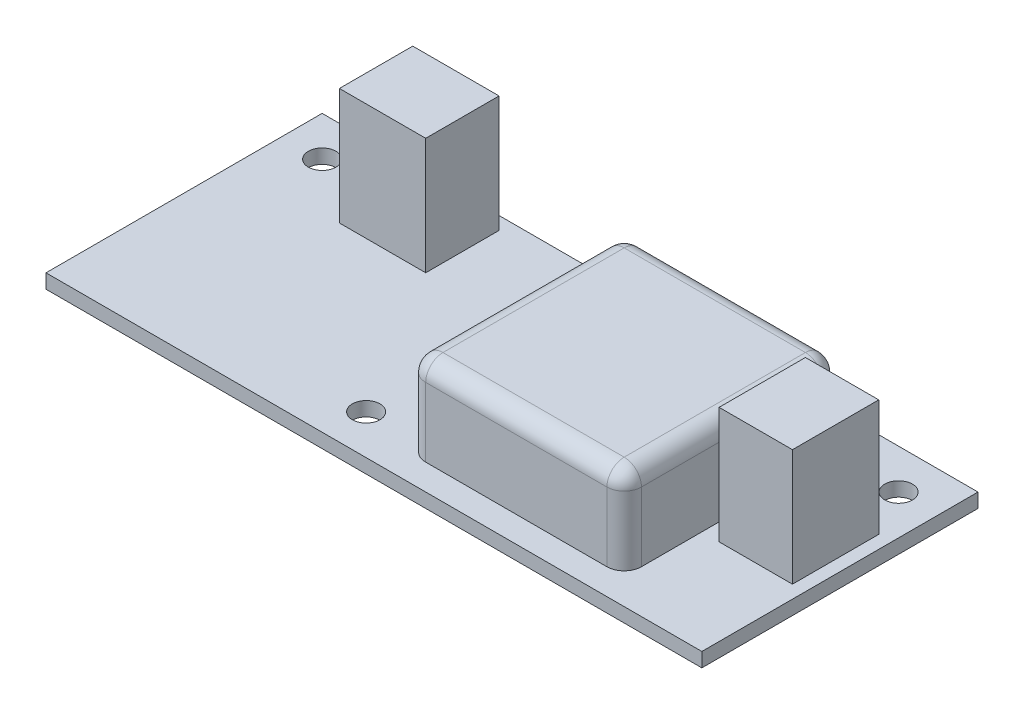
ISO-10303-21;
HEADER;
FILE_DESCRIPTION(('STEP AP214'),'2;1');
FILE_NAME('part.step','',(''),(''),'','','');
FILE_SCHEMA(('AUTOMOTIVE_DESIGN { 1 0 10303 214 1 1 1 1 }'));
ENDSEC;
DATA;
#1=APPLICATION_CONTEXT('core data for automotive mechanical design processes');
#2=APPLICATION_PROTOCOL_DEFINITION('international standard','automotive_design',2000,#1);
#3=PRODUCT_CONTEXT('',#1,'mechanical');
#4=PRODUCT('Part','Part','',(#3));
#5=PRODUCT_RELATED_PRODUCT_CATEGORY('part','',(#4));
#6=PRODUCT_DEFINITION_FORMATION('','',#4);
#7=PRODUCT_DEFINITION_CONTEXT('part definition',#1,'design');
#8=PRODUCT_DEFINITION('design','',#6,#7);
#9=PRODUCT_DEFINITION_SHAPE('','',#8);
#10=(LENGTH_UNIT() NAMED_UNIT(*) SI_UNIT(.MILLI.,.METRE.));
#11=(NAMED_UNIT(*) PLANE_ANGLE_UNIT() SI_UNIT($,.RADIAN.));
#12=(NAMED_UNIT(*) SI_UNIT($,.STERADIAN.) SOLID_ANGLE_UNIT());
#13=UNCERTAINTY_MEASURE_WITH_UNIT(LENGTH_MEASURE(1.E-05),#10,'distance_accuracy_value','');
#14=(GEOMETRIC_REPRESENTATION_CONTEXT(3) GLOBAL_UNCERTAINTY_ASSIGNED_CONTEXT((#13)) GLOBAL_UNIT_ASSIGNED_CONTEXT((#10,
#11,#12)) REPRESENTATION_CONTEXT('',''));
#15=CARTESIAN_POINT('',(0.,0.,0.));
#16=DIRECTION('',(0.,0.,1.));
#17=DIRECTION('',(1.,0.,0.));
#18=AXIS2_PLACEMENT_3D('',#15,#16,#17);
#19=CARTESIAN_POINT('',(0.,1.65,0.));
#20=DIRECTION('',(0.,-1.,0.));
#21=DIRECTION('',(0.,0.,-1.));
#22=AXIS2_PLACEMENT_3D('',#19,#20,#21);
#23=PLANE('',#22);
#24=DIRECTION('',(0.,0.,1.));
#25=VECTOR('',#24,1.);
#26=CARTESIAN_POINT('',(66.,1.65,-22.));
#27=LINE('',#26,#25);
#28=CARTESIAN_POINT('',(66.,1.65,-22.));
#29=VERTEX_POINT('',#28);
#30=CARTESIAN_POINT('',(66.,1.65,-12.));
#31=VERTEX_POINT('',#30);
#32=EDGE_CURVE('E206',#29,#31,#27,.T.);
#33=ORIENTED_EDGE('',*,*,#32,.F.);
#34=DIRECTION('',(-1.,0.,0.));
#35=VECTOR('',#34,1.);
#36=CARTESIAN_POINT('',(66.,1.65,-22.));
#37=LINE('',#36,#35);
#38=CARTESIAN_POINT('',(74.5,1.65,-22.));
#39=VERTEX_POINT('',#38);
#40=EDGE_CURVE('E203',#39,#29,#37,.T.);
#41=ORIENTED_EDGE('',*,*,#40,.F.);
#42=DIRECTION('',(0.,0.,-1.));
#43=VECTOR('',#42,1.);
#44=CARTESIAN_POINT('',(74.5,1.65,-22.));
#45=LINE('',#44,#43);
#46=CARTESIAN_POINT('',(74.5,1.65,-12.));
#47=VERTEX_POINT('',#46);
#48=EDGE_CURVE('E385',#47,#39,#45,.T.);
#49=ORIENTED_EDGE('',*,*,#48,.F.);
#50=DIRECTION('',(1.,0.,0.));
#51=VECTOR('',#50,1.);
#52=CARTESIAN_POINT('',(66.,1.65,-12.));
#53=LINE('',#52,#51);
#54=EDGE_CURVE('E383',#31,#47,#53,.T.);
#55=ORIENTED_EDGE('',*,*,#54,.F.);
#56=EDGE_LOOP('',(#33,#41,#49,#55));
#57=FACE_BOUND('',#56,.T.);
#58=DIRECTION('',(0.,0.,-1.));
#59=VECTOR('',#58,1.);
#60=CARTESIAN_POINT('',(0.,1.65,0.));
#61=LINE('',#60,#59);
#62=CARTESIAN_POINT('',(0.,1.65,0.));
#63=VERTEX_POINT('',#62);
#64=CARTESIAN_POINT('',(0.,1.65,-32.));
#65=VERTEX_POINT('',#64);
#66=EDGE_CURVE('E260',#63,#65,#61,.T.);
#67=ORIENTED_EDGE('',*,*,#66,.F.);
#68=DIRECTION('',(1.,0.,0.));
#69=VECTOR('',#68,1.);
#70=CARTESIAN_POINT('',(0.,1.65,0.));
#71=LINE('',#70,#69);
#72=CARTESIAN_POINT('',(76.,1.65,0.));
#73=VERTEX_POINT('',#72);
#74=EDGE_CURVE('E269',#63,#73,#71,.T.);
#75=ORIENTED_EDGE('',*,*,#74,.T.);
#76=DIRECTION('',(0.,0.,-1.));
#77=VECTOR('',#76,1.);
#78=CARTESIAN_POINT('',(76.,1.65,0.));
#79=LINE('',#78,#77);
#80=CARTESIAN_POINT('',(76.,1.65,-32.));
#81=VERTEX_POINT('',#80);
#82=EDGE_CURVE('E267',#73,#81,#79,.T.);
#83=ORIENTED_EDGE('',*,*,#82,.T.);
#84=DIRECTION('',(1.,0.,0.));
#85=VECTOR('',#84,1.);
#86=CARTESIAN_POINT('',(0.,1.65,-32.));
#87=LINE('',#86,#85);
#88=EDGE_CURVE('E263',#65,#81,#87,.T.);
#89=ORIENTED_EDGE('',*,*,#88,.F.);
#90=EDGE_LOOP('',(#67,#75,#83,#89));
#91=FACE_BOUND('',#90,.T.);
#92=CARTESIAN_POINT('',(4.6,1.65,-27.4));
#93=DIRECTION('',(0.,1.,0.));
#94=DIRECTION('',(0.,0.,1.));
#95=AXIS2_PLACEMENT_3D('',#92,#93,#94);
#96=CIRCLE('',#95,1.59999999999999);
#97=CARTESIAN_POINT('',(4.6,1.65,-25.8));
#98=VERTEX_POINT('',#97);
#99=EDGE_CURVE('E253',#98,#98,#96,.T.);
#100=ORIENTED_EDGE('',*,*,#99,.F.);
#101=EDGE_LOOP('',(#100));
#102=FACE_BOUND('',#101,.T.);
#103=CARTESIAN_POINT('',(32.5,1.65,-4.6));
#104=DIRECTION('',(0.,1.,0.));
#105=DIRECTION('',(0.,0.,1.));
#106=AXIS2_PLACEMENT_3D('',#103,#104,#105);
#107=CIRCLE('',#106,1.59999999999999);
#108=CARTESIAN_POINT('',(32.5,1.65,-3.00000000000001));
#109=VERTEX_POINT('',#108);
#110=EDGE_CURVE('E249',#109,#109,#107,.T.);
#111=ORIENTED_EDGE('',*,*,#110,.F.);
#112=EDGE_LOOP('',(#111));
#113=FACE_BOUND('',#112,.T.);
#114=CARTESIAN_POINT('',(71.4,1.65,-27.4));
#115=DIRECTION('',(0.,1.,0.));
#116=DIRECTION('',(0.,0.,1.));
#117=AXIS2_PLACEMENT_3D('',#114,#115,#116);
#118=CIRCLE('',#117,1.59999999999999);
#119=CARTESIAN_POINT('',(71.4,1.65,-25.8));
#120=VERTEX_POINT('',#119);
#121=EDGE_CURVE('E245',#120,#120,#118,.T.);
#122=ORIENTED_EDGE('',*,*,#121,.F.);
#123=EDGE_LOOP('',(#122));
#124=FACE_BOUND('',#123,.T.);
#125=DIRECTION('',(0.,0.,1.));
#126=VECTOR('',#125,1.);
#127=CARTESIAN_POINT('',(12.,1.65,-30.5));
#128=LINE('',#127,#126);
#129=CARTESIAN_POINT('',(12.,1.65,-30.5));
#130=VERTEX_POINT('',#129);
#131=CARTESIAN_POINT('',(12.,1.65,-22.));
#132=VERTEX_POINT('',#131);
#133=EDGE_CURVE('E207',#130,#132,#128,.T.);
#134=ORIENTED_EDGE('',*,*,#133,.F.);
#135=DIRECTION('',(-1.,0.,0.));
#136=VECTOR('',#135,1.);
#137=CARTESIAN_POINT('',(12.,1.65,-30.5));
#138=LINE('',#137,#136);
#139=CARTESIAN_POINT('',(22.,1.65,-30.5));
#140=VERTEX_POINT('',#139);
#141=EDGE_CURVE('E220',#140,#130,#138,.T.);
#142=ORIENTED_EDGE('',*,*,#141,.F.);
#143=DIRECTION('',(0.,0.,-1.));
#144=VECTOR('',#143,1.);
#145=CARTESIAN_POINT('',(22.,1.65,-30.5));
#146=LINE('',#145,#144);
#147=CARTESIAN_POINT('',(22.,1.65,-22.));
#148=VERTEX_POINT('',#147);
#149=EDGE_CURVE('E229',#148,#140,#146,.T.);
#150=ORIENTED_EDGE('',*,*,#149,.F.);
#151=DIRECTION('',(1.,0.,0.));
#152=VECTOR('',#151,1.);
#153=CARTESIAN_POINT('',(12.,1.65,-22.));
#154=LINE('',#153,#152);
#155=EDGE_CURVE('E210',#132,#148,#154,.T.);
#156=ORIENTED_EDGE('',*,*,#155,.F.);
#157=EDGE_LOOP('',(#134,#142,#150,#156));
#158=FACE_BOUND('',#157,.T.);
#159=DIRECTION('',(0.,0.,-1.));
#160=VECTOR('',#159,1.);
#161=CARTESIAN_POINT('',(64.,1.65,-3.));
#162=LINE('',#161,#160);
#163=CARTESIAN_POINT('',(64.,1.65,-5.));
#164=VERTEX_POINT('',#163);
#165=CARTESIAN_POINT('',(64.,1.65,-26.));
#166=VERTEX_POINT('',#165);
#167=EDGE_CURVE('E363',#164,#166,#162,.T.);
#168=ORIENTED_EDGE('',*,*,#167,.F.);
#169=CARTESIAN_POINT('',(62.,1.65,-5.));
#170=DIRECTION('',(0.,-1.,0.));
#171=DIRECTION('',(0.,0.,-1.));
#172=AXIS2_PLACEMENT_3D('',#169,#170,#171);
#173=CIRCLE('',#172,2.);
#174=CARTESIAN_POINT('',(62.,1.65,-3.));
#175=VERTEX_POINT('',#174);
#176=EDGE_CURVE('E325',#164,#175,#173,.T.);
#177=ORIENTED_EDGE('',*,*,#176,.T.);
#178=DIRECTION('',(1.,0.,0.));
#179=VECTOR('',#178,1.);
#180=CARTESIAN_POINT('',(39.,1.65,-3.));
#181=LINE('',#180,#179);
#182=CARTESIAN_POINT('',(41.,1.65,-3.));
#183=VERTEX_POINT('',#182);
#184=EDGE_CURVE('E377',#183,#175,#181,.T.);
#185=ORIENTED_EDGE('',*,*,#184,.F.);
#186=CARTESIAN_POINT('',(41.,1.65,-5.));
#187=DIRECTION('',(0.,-1.,0.));
#188=DIRECTION('',(0.,0.,-1.));
#189=AXIS2_PLACEMENT_3D('',#186,#187,#188);
#190=CIRCLE('',#189,2.);
#191=CARTESIAN_POINT('',(39.,1.65,-5.));
#192=VERTEX_POINT('',#191);
#193=EDGE_CURVE('E327',#183,#192,#190,.T.);
#194=ORIENTED_EDGE('',*,*,#193,.T.);
#195=DIRECTION('',(0.,0.,1.));
#196=VECTOR('',#195,1.);
#197=CARTESIAN_POINT('',(39.,1.65,-3.));
#198=LINE('',#197,#196);
#199=CARTESIAN_POINT('',(39.,1.65,-26.));
#200=VERTEX_POINT('',#199);
#201=EDGE_CURVE('E372',#200,#192,#198,.T.);
#202=ORIENTED_EDGE('',*,*,#201,.F.);
#203=CARTESIAN_POINT('',(41.,1.65,-26.));
#204=DIRECTION('',(0.,-1.,0.));
#205=DIRECTION('',(0.,0.,-1.));
#206=AXIS2_PLACEMENT_3D('',#203,#204,#205);
#207=CIRCLE('',#206,2.);
#208=CARTESIAN_POINT('',(41.,1.65,-28.));
#209=VERTEX_POINT('',#208);
#210=EDGE_CURVE('E41',#200,#209,#207,.T.);
#211=ORIENTED_EDGE('',*,*,#210,.T.);
#212=DIRECTION('',(-1.,0.,0.));
#213=VECTOR('',#212,1.);
#214=CARTESIAN_POINT('',(39.,1.65,-28.));
#215=LINE('',#214,#213);
#216=CARTESIAN_POINT('',(62.,1.65,-28.));
#217=VERTEX_POINT('',#216);
#218=EDGE_CURVE('E366',#217,#209,#215,.T.);
#219=ORIENTED_EDGE('',*,*,#218,.F.);
#220=CARTESIAN_POINT('',(62.,1.65,-26.));
#221=DIRECTION('',(0.,-1.,0.));
#222=DIRECTION('',(0.,0.,-1.));
#223=AXIS2_PLACEMENT_3D('',#220,#221,#222);
#224=CIRCLE('',#223,2.);
#225=EDGE_CURVE('E11',#217,#166,#224,.T.);
#226=ORIENTED_EDGE('',*,*,#225,.T.);
#227=EDGE_LOOP('',(#168,#177,#185,#194,#202,#211,#219,#226));
#228=FACE_BOUND('',#227,.T.);
#229=ADVANCED_FACE('F32',(#57,#91,#102,#113,#124,#158,#228),#23,.F.);
#230=CARTESIAN_POINT('',(0.,1.65,0.));
#231=DIRECTION('',(-1.,0.,0.));
#232=DIRECTION('',(0.,0.,1.));
#233=AXIS2_PLACEMENT_3D('',#230,#231,#232);
#234=PLANE('',#233);
#235=DIRECTION('',(0.,0.,-1.));
#236=VECTOR('',#235,1.);
#237=CARTESIAN_POINT('',(0.,0.,0.));
#238=LINE('',#237,#236);
#239=CARTESIAN_POINT('',(0.,0.,0.));
#240=VERTEX_POINT('',#239);
#241=CARTESIAN_POINT('',(0.,0.,-32.));
#242=VERTEX_POINT('',#241);
#243=EDGE_CURVE('E259',#240,#242,#238,.T.);
#244=ORIENTED_EDGE('',*,*,#243,.F.);
#245=DIRECTION('',(0.,-1.,0.));
#246=VECTOR('',#245,1.);
#247=CARTESIAN_POINT('',(0.,1.65,0.));
#248=LINE('',#247,#246);
#249=EDGE_CURVE('E281',#63,#240,#248,.T.);
#250=ORIENTED_EDGE('',*,*,#249,.F.);
#251=ORIENTED_EDGE('',*,*,#66,.T.);
#252=DIRECTION('',(0.,-1.,0.));
#253=VECTOR('',#252,1.);
#254=CARTESIAN_POINT('',(0.,1.65,-32.));
#255=LINE('',#254,#253);
#256=EDGE_CURVE('E271',#65,#242,#255,.T.);
#257=ORIENTED_EDGE('',*,*,#256,.T.);
#258=EDGE_LOOP('',(#244,#250,#251,#257));
#259=FACE_BOUND('',#258,.T.);
#260=ADVANCED_FACE('F399',(#259),#234,.T.);
#261=CARTESIAN_POINT('',(0.,1.65,0.));
#262=DIRECTION('',(0.,0.,-1.));
#263=DIRECTION('',(-1.,0.,0.));
#264=AXIS2_PLACEMENT_3D('',#261,#262,#263);
#265=PLANE('',#264);
#266=DIRECTION('',(1.,0.,0.));
#267=VECTOR('',#266,1.);
#268=CARTESIAN_POINT('',(0.,0.,0.));
#269=LINE('',#268,#267);
#270=CARTESIAN_POINT('',(76.,0.,0.));
#271=VERTEX_POINT('',#270);
#272=EDGE_CURVE('E264',#240,#271,#269,.T.);
#273=ORIENTED_EDGE('',*,*,#272,.T.);
#274=DIRECTION('',(0.,-1.,0.));
#275=VECTOR('',#274,1.);
#276=CARTESIAN_POINT('',(76.,1.65,0.));
#277=LINE('',#276,#275);
#278=EDGE_CURVE('E284',#73,#271,#277,.T.);
#279=ORIENTED_EDGE('',*,*,#278,.F.);
#280=ORIENTED_EDGE('',*,*,#74,.F.);
#281=ORIENTED_EDGE('',*,*,#249,.T.);
#282=EDGE_LOOP('',(#273,#279,#280,#281));
#283=FACE_BOUND('',#282,.T.);
#284=ADVANCED_FACE('F539',(#283),#265,.F.);
#285=CARTESIAN_POINT('',(76.,1.65,0.));
#286=DIRECTION('',(-1.,0.,0.));
#287=DIRECTION('',(0.,0.,1.));
#288=AXIS2_PLACEMENT_3D('',#285,#286,#287);
#289=PLANE('',#288);
#290=DIRECTION('',(0.,0.,-1.));
#291=VECTOR('',#290,1.);
#292=CARTESIAN_POINT('',(76.,0.,0.));
#293=LINE('',#292,#291);
#294=CARTESIAN_POINT('',(76.,0.,-32.));
#295=VERTEX_POINT('',#294);
#296=EDGE_CURVE('E277',#271,#295,#293,.T.);
#297=ORIENTED_EDGE('',*,*,#296,.T.);
#298=DIRECTION('',(0.,-1.,0.));
#299=VECTOR('',#298,1.);
#300=CARTESIAN_POINT('',(76.,1.65,-32.));
#301=LINE('',#300,#299);
#302=EDGE_CURVE('E287',#81,#295,#301,.T.);
#303=ORIENTED_EDGE('',*,*,#302,.F.);
#304=ORIENTED_EDGE('',*,*,#82,.F.);
#305=ORIENTED_EDGE('',*,*,#278,.T.);
#306=EDGE_LOOP('',(#297,#303,#304,#305));
#307=FACE_BOUND('',#306,.T.);
#308=ADVANCED_FACE('F542',(#307),#289,.F.);
#309=CARTESIAN_POINT('',(0.,1.65,-32.));
#310=DIRECTION('',(0.,0.,-1.));
#311=DIRECTION('',(-1.,0.,0.));
#312=AXIS2_PLACEMENT_3D('',#309,#310,#311);
#313=PLANE('',#312);
#314=DIRECTION('',(1.,0.,0.));
#315=VECTOR('',#314,1.);
#316=CARTESIAN_POINT('',(0.,0.,-32.));
#317=LINE('',#316,#315);
#318=EDGE_CURVE('E274',#242,#295,#317,.T.);
#319=ORIENTED_EDGE('',*,*,#318,.F.);
#320=ORIENTED_EDGE('',*,*,#256,.F.);
#321=ORIENTED_EDGE('',*,*,#88,.T.);
#322=ORIENTED_EDGE('',*,*,#302,.T.);
#323=EDGE_LOOP('',(#319,#320,#321,#322));
#324=FACE_BOUND('',#323,.T.);
#325=ADVANCED_FACE('F537',(#324),#313,.T.);
#326=CARTESIAN_POINT('',(0.,0.,0.));
#327=DIRECTION('',(0.,-1.,0.));
#328=DIRECTION('',(0.,0.,-1.));
#329=AXIS2_PLACEMENT_3D('',#326,#327,#328);
#330=PLANE('',#329);
#331=CARTESIAN_POINT('',(71.4,0.,-27.4));
#332=DIRECTION('',(0.,-1.,0.));
#333=DIRECTION('',(0.,0.,-1.));
#334=AXIS2_PLACEMENT_3D('',#331,#332,#333);
#335=CIRCLE('',#334,1.59999999999999);
#336=CARTESIAN_POINT('',(71.4,0.,-29.));
#337=VERTEX_POINT('',#336);
#338=EDGE_CURVE('E248',#337,#337,#335,.T.);
#339=ORIENTED_EDGE('',*,*,#338,.F.);
#340=EDGE_LOOP('',(#339));
#341=FACE_BOUND('',#340,.T.);
#342=CARTESIAN_POINT('',(32.5,0.,-4.6));
#343=DIRECTION('',(0.,-1.,0.));
#344=DIRECTION('',(0.,0.,-1.));
#345=AXIS2_PLACEMENT_3D('',#342,#343,#344);
#346=CIRCLE('',#345,1.59999999999999);
#347=CARTESIAN_POINT('',(32.5,0.,-6.19999999999999));
#348=VERTEX_POINT('',#347);
#349=EDGE_CURVE('E252',#348,#348,#346,.T.);
#350=ORIENTED_EDGE('',*,*,#349,.F.);
#351=EDGE_LOOP('',(#350));
#352=FACE_BOUND('',#351,.T.);
#353=CARTESIAN_POINT('',(4.6,0.,-27.4));
#354=DIRECTION('',(0.,-1.,0.));
#355=DIRECTION('',(0.,0.,-1.));
#356=AXIS2_PLACEMENT_3D('',#353,#354,#355);
#357=CIRCLE('',#356,1.59999999999999);
#358=CARTESIAN_POINT('',(4.6,0.,-29.));
#359=VERTEX_POINT('',#358);
#360=EDGE_CURVE('E256',#359,#359,#357,.T.);
#361=ORIENTED_EDGE('',*,*,#360,.F.);
#362=EDGE_LOOP('',(#361));
#363=FACE_BOUND('',#362,.T.);
#364=ORIENTED_EDGE('',*,*,#243,.T.);
#365=ORIENTED_EDGE('',*,*,#318,.T.);
#366=ORIENTED_EDGE('',*,*,#296,.F.);
#367=ORIENTED_EDGE('',*,*,#272,.F.);
#368=EDGE_LOOP('',(#364,#365,#366,#367));
#369=FACE_BOUND('',#368,.T.);
#370=ADVANCED_FACE('F532',(#341,#352,#363,#369),#330,.T.);
#371=CARTESIAN_POINT('',(4.6,1.65,-27.4));
#372=DIRECTION('',(0.,1.,0.));
#373=DIRECTION('',(0.,0.,1.));
#374=AXIS2_PLACEMENT_3D('',#371,#372,#373);
#375=CYLINDRICAL_SURFACE('',#374,1.59999999999999);
#376=ORIENTED_EDGE('',*,*,#360,.T.);
#377=EDGE_LOOP('',(#376));
#378=FACE_BOUND('',#377,.T.);
#379=ORIENTED_EDGE('',*,*,#99,.T.);
#380=EDGE_LOOP('',(#379));
#381=FACE_BOUND('',#380,.T.);
#382=ADVANCED_FACE('F529',(#378,#381),#375,.F.);
#383=CARTESIAN_POINT('',(32.5,1.65,-4.6));
#384=DIRECTION('',(0.,1.,0.));
#385=DIRECTION('',(0.,0.,1.));
#386=AXIS2_PLACEMENT_3D('',#383,#384,#385);
#387=CYLINDRICAL_SURFACE('',#386,1.59999999999999);
#388=ORIENTED_EDGE('',*,*,#349,.T.);
#389=EDGE_LOOP('',(#388));
#390=FACE_BOUND('',#389,.T.);
#391=ORIENTED_EDGE('',*,*,#110,.T.);
#392=EDGE_LOOP('',(#391));
#393=FACE_BOUND('',#392,.T.);
#394=ADVANCED_FACE('F525',(#390,#393),#387,.F.);
#395=CARTESIAN_POINT('',(71.4,1.65,-27.4));
#396=DIRECTION('',(0.,1.,0.));
#397=DIRECTION('',(0.,0.,1.));
#398=AXIS2_PLACEMENT_3D('',#395,#396,#397);
#399=CYLINDRICAL_SURFACE('',#398,1.59999999999999);
#400=ORIENTED_EDGE('',*,*,#338,.T.);
#401=EDGE_LOOP('',(#400));
#402=FACE_BOUND('',#401,.T.);
#403=ORIENTED_EDGE('',*,*,#121,.T.);
#404=EDGE_LOOP('',(#403));
#405=FACE_BOUND('',#404,.T.);
#406=ADVANCED_FACE('F521',(#402,#405),#399,.F.);
#407=CARTESIAN_POINT('',(12.,15.15,-30.5));
#408=DIRECTION('',(1.,0.,0.));
#409=DIRECTION('',(0.,0.,-1.));
#410=AXIS2_PLACEMENT_3D('',#407,#408,#409);
#411=PLANE('',#410);
#412=ORIENTED_EDGE('',*,*,#133,.T.);
#413=DIRECTION('',(0.,-1.,0.));
#414=VECTOR('',#413,1.);
#415=CARTESIAN_POINT('',(12.,15.15,-22.));
#416=LINE('',#415,#414);
#417=CARTESIAN_POINT('',(12.,15.15,-22.));
#418=VERTEX_POINT('',#417);
#419=EDGE_CURVE('E242',#418,#132,#416,.T.);
#420=ORIENTED_EDGE('',*,*,#419,.F.);
#421=DIRECTION('',(0.,0.,1.));
#422=VECTOR('',#421,1.);
#423=CARTESIAN_POINT('',(12.,15.15,-30.5));
#424=LINE('',#423,#422);
#425=CARTESIAN_POINT('',(12.,15.15,-30.5));
#426=VERTEX_POINT('',#425);
#427=EDGE_CURVE('E216',#426,#418,#424,.T.);
#428=ORIENTED_EDGE('',*,*,#427,.F.);
#429=DIRECTION('',(0.,-1.,0.));
#430=VECTOR('',#429,1.);
#431=CARTESIAN_POINT('',(12.,15.15,-30.5));
#432=LINE('',#431,#430);
#433=EDGE_CURVE('E225',#426,#130,#432,.T.);
#434=ORIENTED_EDGE('',*,*,#433,.T.);
#435=EDGE_LOOP('',(#412,#420,#428,#434));
#436=FACE_BOUND('',#435,.T.);
#437=ADVANCED_FACE('F517',(#436),#411,.F.);
#438=CARTESIAN_POINT('',(12.,15.15,-22.));
#439=DIRECTION('',(0.,0.,-1.));
#440=DIRECTION('',(-1.,0.,0.));
#441=AXIS2_PLACEMENT_3D('',#438,#439,#440);
#442=PLANE('',#441);
#443=ORIENTED_EDGE('',*,*,#155,.T.);
#444=DIRECTION('',(0.,-1.,0.));
#445=VECTOR('',#444,1.);
#446=CARTESIAN_POINT('',(22.,15.15,-22.));
#447=LINE('',#446,#445);
#448=CARTESIAN_POINT('',(22.,15.15,-22.));
#449=VERTEX_POINT('',#448);
#450=EDGE_CURVE('E239',#449,#148,#447,.T.);
#451=ORIENTED_EDGE('',*,*,#450,.F.);
#452=DIRECTION('',(1.,0.,0.));
#453=VECTOR('',#452,1.);
#454=CARTESIAN_POINT('',(12.,15.15,-22.));
#455=LINE('',#454,#453);
#456=EDGE_CURVE('E219',#418,#449,#455,.T.);
#457=ORIENTED_EDGE('',*,*,#456,.F.);
#458=ORIENTED_EDGE('',*,*,#419,.T.);
#459=EDGE_LOOP('',(#443,#451,#457,#458));
#460=FACE_BOUND('',#459,.T.);
#461=ADVANCED_FACE('F513',(#460),#442,.F.);
#462=CARTESIAN_POINT('',(22.,15.15,-30.5));
#463=DIRECTION('',(-1.,0.,0.));
#464=DIRECTION('',(0.,0.,1.));
#465=AXIS2_PLACEMENT_3D('',#462,#463,#464);
#466=PLANE('',#465);
#467=ORIENTED_EDGE('',*,*,#149,.T.);
#468=DIRECTION('',(0.,-1.,0.));
#469=VECTOR('',#468,1.);
#470=CARTESIAN_POINT('',(22.,15.15,-30.5));
#471=LINE('',#470,#469);
#472=CARTESIAN_POINT('',(22.,15.15,-30.5));
#473=VERTEX_POINT('',#472);
#474=EDGE_CURVE('E236',#473,#140,#471,.T.);
#475=ORIENTED_EDGE('',*,*,#474,.F.);
#476=DIRECTION('',(0.,0.,-1.));
#477=VECTOR('',#476,1.);
#478=CARTESIAN_POINT('',(22.,15.15,-30.5));
#479=LINE('',#478,#477);
#480=EDGE_CURVE('E222',#449,#473,#479,.T.);
#481=ORIENTED_EDGE('',*,*,#480,.F.);
#482=ORIENTED_EDGE('',*,*,#450,.T.);
#483=EDGE_LOOP('',(#467,#475,#481,#482));
#484=FACE_BOUND('',#483,.T.);
#485=ADVANCED_FACE('F509',(#484),#466,.F.);
#486=CARTESIAN_POINT('',(12.,15.15,-30.5));
#487=DIRECTION('',(0.,0.,1.));
#488=DIRECTION('',(1.,0.,0.));
#489=AXIS2_PLACEMENT_3D('',#486,#487,#488);
#490=PLANE('',#489);
#491=ORIENTED_EDGE('',*,*,#141,.T.);
#492=ORIENTED_EDGE('',*,*,#433,.F.);
#493=DIRECTION('',(-1.,0.,0.));
#494=VECTOR('',#493,1.);
#495=CARTESIAN_POINT('',(12.,15.15,-30.5));
#496=LINE('',#495,#494);
#497=EDGE_CURVE('E224',#473,#426,#496,.T.);
#498=ORIENTED_EDGE('',*,*,#497,.F.);
#499=ORIENTED_EDGE('',*,*,#474,.T.);
#500=EDGE_LOOP('',(#491,#492,#498,#499));
#501=FACE_BOUND('',#500,.T.);
#502=ADVANCED_FACE('F505',(#501),#490,.F.);
#503=CARTESIAN_POINT('',(0.,15.15,0.));
#504=DIRECTION('',(0.,1.,0.));
#505=DIRECTION('',(0.,0.,1.));
#506=AXIS2_PLACEMENT_3D('',#503,#504,#505);
#507=PLANE('',#506);
#508=ORIENTED_EDGE('',*,*,#427,.T.);
#509=ORIENTED_EDGE('',*,*,#456,.T.);
#510=ORIENTED_EDGE('',*,*,#480,.T.);
#511=ORIENTED_EDGE('',*,*,#497,.T.);
#512=EDGE_LOOP('',(#508,#509,#510,#511));
#513=FACE_BOUND('',#512,.T.);
#514=ADVANCED_FACE('F502',(#513),#507,.T.);
#515=CARTESIAN_POINT('',(66.,15.15,-22.));
#516=DIRECTION('',(1.,0.,0.));
#517=DIRECTION('',(0.,0.,-1.));
#518=AXIS2_PLACEMENT_3D('',#515,#516,#517);
#519=PLANE('',#518);
#520=ORIENTED_EDGE('',*,*,#32,.T.);
#521=DIRECTION('',(0.,-1.,0.));
#522=VECTOR('',#521,1.);
#523=CARTESIAN_POINT('',(66.,15.15,-12.));
#524=LINE('',#523,#522);
#525=CARTESIAN_POINT('',(66.,15.15,-12.));
#526=VERTEX_POINT('',#525);
#527=EDGE_CURVE('E187',#526,#31,#524,.T.);
#528=ORIENTED_EDGE('',*,*,#527,.F.);
#529=DIRECTION('',(0.,0.,1.));
#530=VECTOR('',#529,1.);
#531=CARTESIAN_POINT('',(66.,15.15,-22.));
#532=LINE('',#531,#530);
#533=CARTESIAN_POINT('',(66.,15.15,-22.));
#534=VERTEX_POINT('',#533);
#535=EDGE_CURVE('E194',#534,#526,#532,.T.);
#536=ORIENTED_EDGE('',*,*,#535,.F.);
#537=DIRECTION('',(0.,-1.,0.));
#538=VECTOR('',#537,1.);
#539=CARTESIAN_POINT('',(66.,15.15,-22.));
#540=LINE('',#539,#538);
#541=EDGE_CURVE('E381',#534,#29,#540,.T.);
#542=ORIENTED_EDGE('',*,*,#541,.T.);
#543=EDGE_LOOP('',(#520,#528,#536,#542));
#544=FACE_BOUND('',#543,.T.);
#545=ADVANCED_FACE('F205',(#544),#519,.F.);
#546=CARTESIAN_POINT('',(66.,15.15,-12.));
#547=DIRECTION('',(0.,0.,-1.));
#548=DIRECTION('',(-1.,0.,0.));
#549=AXIS2_PLACEMENT_3D('',#546,#547,#548);
#550=PLANE('',#549);
#551=ORIENTED_EDGE('',*,*,#54,.T.);
#552=DIRECTION('',(0.,-1.,0.));
#553=VECTOR('',#552,1.);
#554=CARTESIAN_POINT('',(74.5,15.15,-12.));
#555=LINE('',#554,#553);
#556=CARTESIAN_POINT('',(74.5,15.15,-12.));
#557=VERTEX_POINT('',#556);
#558=EDGE_CURVE('E190',#557,#47,#555,.T.);
#559=ORIENTED_EDGE('',*,*,#558,.F.);
#560=DIRECTION('',(1.,0.,0.));
#561=VECTOR('',#560,1.);
#562=CARTESIAN_POINT('',(66.,15.15,-12.));
#563=LINE('',#562,#561);
#564=EDGE_CURVE('E182',#526,#557,#563,.T.);
#565=ORIENTED_EDGE('',*,*,#564,.F.);
#566=ORIENTED_EDGE('',*,*,#527,.T.);
#567=EDGE_LOOP('',(#551,#559,#565,#566));
#568=FACE_BOUND('',#567,.T.);
#569=ADVANCED_FACE('F185',(#568),#550,.F.);
#570=CARTESIAN_POINT('',(74.5,15.15,-22.));
#571=DIRECTION('',(-1.,0.,0.));
#572=DIRECTION('',(0.,0.,1.));
#573=AXIS2_PLACEMENT_3D('',#570,#571,#572);
#574=PLANE('',#573);
#575=ORIENTED_EDGE('',*,*,#48,.T.);
#576=DIRECTION('',(0.,-1.,0.));
#577=VECTOR('',#576,1.);
#578=CARTESIAN_POINT('',(74.5,15.15,-22.));
#579=LINE('',#578,#577);
#580=CARTESIAN_POINT('',(74.5,15.15,-22.));
#581=VERTEX_POINT('',#580);
#582=EDGE_CURVE('E212',#581,#39,#579,.T.);
#583=ORIENTED_EDGE('',*,*,#582,.F.);
#584=DIRECTION('',(0.,0.,-1.));
#585=VECTOR('',#584,1.);
#586=CARTESIAN_POINT('',(74.5,15.15,-22.));
#587=LINE('',#586,#585);
#588=EDGE_CURVE('E193',#557,#581,#587,.T.);
#589=ORIENTED_EDGE('',*,*,#588,.F.);
#590=ORIENTED_EDGE('',*,*,#558,.T.);
#591=EDGE_LOOP('',(#575,#583,#589,#590));
#592=FACE_BOUND('',#591,.T.);
#593=ADVANCED_FACE('F395',(#592),#574,.F.);
#594=CARTESIAN_POINT('',(66.,15.15,-22.));
#595=DIRECTION('',(0.,0.,1.));
#596=DIRECTION('',(1.,0.,0.));
#597=AXIS2_PLACEMENT_3D('',#594,#595,#596);
#598=PLANE('',#597);
#599=ORIENTED_EDGE('',*,*,#40,.T.);
#600=ORIENTED_EDGE('',*,*,#541,.F.);
#601=DIRECTION('',(-1.,0.,0.));
#602=VECTOR('',#601,1.);
#603=CARTESIAN_POINT('',(66.,15.15,-22.));
#604=LINE('',#603,#602);
#605=EDGE_CURVE('E199',#581,#534,#604,.T.);
#606=ORIENTED_EDGE('',*,*,#605,.F.);
#607=ORIENTED_EDGE('',*,*,#582,.T.);
#608=EDGE_LOOP('',(#599,#600,#606,#607));
#609=FACE_BOUND('',#608,.T.);
#610=ADVANCED_FACE('F393',(#609),#598,.F.);
#611=CARTESIAN_POINT('',(0.,15.15,0.));
#612=DIRECTION('',(0.,1.,0.));
#613=DIRECTION('',(0.,0.,1.));
#614=AXIS2_PLACEMENT_3D('',#611,#612,#613);
#615=PLANE('',#614);
#616=ORIENTED_EDGE('',*,*,#535,.T.);
#617=ORIENTED_EDGE('',*,*,#564,.T.);
#618=ORIENTED_EDGE('',*,*,#588,.T.);
#619=ORIENTED_EDGE('',*,*,#605,.T.);
#620=EDGE_LOOP('',(#616,#617,#618,#619));
#621=FACE_BOUND('',#620,.T.);
#622=ADVANCED_FACE('F197',(#621),#615,.T.);
#623=CARTESIAN_POINT('',(64.,11.65,-3.));
#624=DIRECTION('',(-1.,0.,0.));
#625=DIRECTION('',(0.,0.,1.));
#626=AXIS2_PLACEMENT_3D('',#623,#624,#625);
#627=PLANE('',#626);
#628=DIRECTION('',(0.,0.,-1.));
#629=VECTOR('',#628,1.);
#630=CARTESIAN_POINT('',(64.,9.65,-3.));
#631=LINE('',#630,#629);
#632=CARTESIAN_POINT('',(64.,9.65,-26.));
#633=VERTEX_POINT('',#632);
#634=CARTESIAN_POINT('',(64.,9.65,-5.));
#635=VERTEX_POINT('',#634);
#636=EDGE_CURVE('E317',#633,#635,#631,.F.);
#637=ORIENTED_EDGE('',*,*,#636,.T.);
#638=DIRECTION('',(0.,-1.,0.));
#639=VECTOR('',#638,1.);
#640=CARTESIAN_POINT('',(64.,11.65,-5.));
#641=LINE('',#640,#639);
#642=EDGE_CURVE('E319',#635,#164,#641,.T.);
#643=ORIENTED_EDGE('',*,*,#642,.T.);
#644=ORIENTED_EDGE('',*,*,#167,.T.);
#645=DIRECTION('',(0.,-1.,0.));
#646=VECTOR('',#645,1.);
#647=CARTESIAN_POINT('',(64.,11.65,-26.));
#648=LINE('',#647,#646);
#649=EDGE_CURVE('E315',#166,#633,#648,.F.);
#650=ORIENTED_EDGE('',*,*,#649,.T.);
#651=EDGE_LOOP('',(#637,#643,#644,#650));
#652=FACE_BOUND('',#651,.T.);
#653=ADVANCED_FACE('F489',(#652),#627,.F.);
#654=CARTESIAN_POINT('',(39.,11.65,-28.));
#655=DIRECTION('',(0.,0.,1.));
#656=DIRECTION('',(1.,0.,0.));
#657=AXIS2_PLACEMENT_3D('',#654,#655,#656);
#658=PLANE('',#657);
#659=ORIENTED_EDGE('',*,*,#218,.T.);
#660=DIRECTION('',(0.,-1.,0.));
#661=VECTOR('',#660,1.);
#662=CARTESIAN_POINT('',(41.,11.65,-28.));
#663=LINE('',#662,#661);
#664=CARTESIAN_POINT('',(41.,9.65,-28.));
#665=VERTEX_POINT('',#664);
#666=EDGE_CURVE('E313',#209,#665,#663,.F.);
#667=ORIENTED_EDGE('',*,*,#666,.T.);
#668=DIRECTION('',(-1.,0.,0.));
#669=VECTOR('',#668,1.);
#670=CARTESIAN_POINT('',(39.,9.65,-28.));
#671=LINE('',#670,#669);
#672=CARTESIAN_POINT('',(62.,9.65,-28.));
#673=VERTEX_POINT('',#672);
#674=EDGE_CURVE('E311',#665,#673,#671,.F.);
#675=ORIENTED_EDGE('',*,*,#674,.T.);
#676=DIRECTION('',(0.,-1.,0.));
#677=VECTOR('',#676,1.);
#678=CARTESIAN_POINT('',(62.,11.65,-28.));
#679=LINE('',#678,#677);
#680=EDGE_CURVE('E309',#673,#217,#679,.T.);
#681=ORIENTED_EDGE('',*,*,#680,.T.);
#682=EDGE_LOOP('',(#659,#667,#675,#681));
#683=FACE_BOUND('',#682,.T.);
#684=ADVANCED_FACE('F450',(#683),#658,.F.);
#685=CARTESIAN_POINT('',(39.,11.65,-3.));
#686=DIRECTION('',(1.,0.,0.));
#687=DIRECTION('',(0.,0.,-1.));
#688=AXIS2_PLACEMENT_3D('',#685,#686,#687);
#689=PLANE('',#688);
#690=ORIENTED_EDGE('',*,*,#201,.T.);
#691=DIRECTION('',(0.,-1.,0.));
#692=VECTOR('',#691,1.);
#693=CARTESIAN_POINT('',(39.,11.65,-5.));
#694=LINE('',#693,#692);
#695=CARTESIAN_POINT('',(39.,9.65,-5.));
#696=VERTEX_POINT('',#695);
#697=EDGE_CURVE('E307',#192,#696,#694,.F.);
#698=ORIENTED_EDGE('',*,*,#697,.T.);
#699=DIRECTION('',(0.,0.,1.));
#700=VECTOR('',#699,1.);
#701=CARTESIAN_POINT('',(39.,9.65,-3.));
#702=LINE('',#701,#700);
#703=CARTESIAN_POINT('',(39.,9.65,-26.));
#704=VERTEX_POINT('',#703);
#705=EDGE_CURVE('E304',#696,#704,#702,.F.);
#706=ORIENTED_EDGE('',*,*,#705,.T.);
#707=DIRECTION('',(0.,-1.,0.));
#708=VECTOR('',#707,1.);
#709=CARTESIAN_POINT('',(39.,11.65,-26.));
#710=LINE('',#709,#708);
#711=EDGE_CURVE('E302',#704,#200,#710,.T.);
#712=ORIENTED_EDGE('',*,*,#711,.T.);
#713=EDGE_LOOP('',(#690,#698,#706,#712));
#714=FACE_BOUND('',#713,.T.);
#715=ADVANCED_FACE('F440',(#714),#689,.F.);
#716=CARTESIAN_POINT('',(39.,11.65,-3.));
#717=DIRECTION('',(0.,0.,-1.));
#718=DIRECTION('',(-1.,0.,0.));
#719=AXIS2_PLACEMENT_3D('',#716,#717,#718);
#720=PLANE('',#719);
#721=ORIENTED_EDGE('',*,*,#184,.T.);
#722=DIRECTION('',(0.,-1.,0.));
#723=VECTOR('',#722,1.);
#724=CARTESIAN_POINT('',(62.,11.65,-3.));
#725=LINE('',#724,#723);
#726=CARTESIAN_POINT('',(62.,9.65,-3.));
#727=VERTEX_POINT('',#726);
#728=EDGE_CURVE('E49',#175,#727,#725,.F.);
#729=ORIENTED_EDGE('',*,*,#728,.T.);
#730=DIRECTION('',(1.,0.,0.));
#731=VECTOR('',#730,1.);
#732=CARTESIAN_POINT('',(39.,9.65,-3.));
#733=LINE('',#732,#731);
#734=CARTESIAN_POINT('',(41.,9.65,-3.));
#735=VERTEX_POINT('',#734);
#736=EDGE_CURVE('E54',#727,#735,#733,.F.);
#737=ORIENTED_EDGE('',*,*,#736,.T.);
#738=DIRECTION('',(0.,-1.,0.));
#739=VECTOR('',#738,1.);
#740=CARTESIAN_POINT('',(41.,11.65,-3.));
#741=LINE('',#740,#739);
#742=EDGE_CURVE('E321',#735,#183,#741,.T.);
#743=ORIENTED_EDGE('',*,*,#742,.T.);
#744=EDGE_LOOP('',(#721,#729,#737,#743));
#745=FACE_BOUND('',#744,.T.);
#746=ADVANCED_FACE('F478',(#745),#720,.F.);
#747=CARTESIAN_POINT('',(0.,11.65,0.));
#748=DIRECTION('',(0.,-1.,0.));
#749=DIRECTION('',(0.,0.,-1.));
#750=AXIS2_PLACEMENT_3D('',#747,#748,#749);
#751=PLANE('',#750);
#752=DIRECTION('',(-1.,0.,0.));
#753=VECTOR('',#752,1.);
#754=CARTESIAN_POINT('',(0.,11.65,-26.));
#755=LINE('',#754,#753);
#756=CARTESIAN_POINT('',(62.,11.65,-26.));
#757=VERTEX_POINT('',#756);
#758=CARTESIAN_POINT('',(41.,11.65,-26.));
#759=VERTEX_POINT('',#758);
#760=EDGE_CURVE('E297',#757,#759,#755,.T.);
#761=ORIENTED_EDGE('',*,*,#760,.T.);
#762=DIRECTION('',(0.,0.,1.));
#763=VECTOR('',#762,1.);
#764=CARTESIAN_POINT('',(41.,11.65,0.));
#765=LINE('',#764,#763);
#766=CARTESIAN_POINT('',(41.,11.65,-5.));
#767=VERTEX_POINT('',#766);
#768=EDGE_CURVE('E299',#759,#767,#765,.T.);
#769=ORIENTED_EDGE('',*,*,#768,.T.);
#770=DIRECTION('',(1.,0.,0.));
#771=VECTOR('',#770,1.);
#772=CARTESIAN_POINT('',(0.,11.65,-5.));
#773=LINE('',#772,#771);
#774=CARTESIAN_POINT('',(62.,11.65,-5.));
#775=VERTEX_POINT('',#774);
#776=EDGE_CURVE('E283',#767,#775,#773,.T.);
#777=ORIENTED_EDGE('',*,*,#776,.T.);
#778=DIRECTION('',(0.,0.,-1.));
#779=VECTOR('',#778,1.);
#780=CARTESIAN_POINT('',(62.,11.65,0.));
#781=LINE('',#780,#779);
#782=EDGE_CURVE('E295',#775,#757,#781,.T.);
#783=ORIENTED_EDGE('',*,*,#782,.T.);
#784=EDGE_LOOP('',(#761,#769,#777,#783));
#785=FACE_BOUND('',#784,.T.);
#786=ADVANCED_FACE('F472',(#785),#751,.F.);
#787=CARTESIAN_POINT('',(62.,11.65,-26.));
#788=DIRECTION('',(0.,-1.,0.));
#789=DIRECTION('',(0.,0.,-1.));
#790=AXIS2_PLACEMENT_3D('',#787,#788,#789);
#791=CYLINDRICAL_SURFACE('',#790,2.);
#792=ORIENTED_EDGE('',*,*,#225,.F.);
#793=ORIENTED_EDGE('',*,*,#680,.F.);
#794=CARTESIAN_POINT('',(62.,9.65,-26.));
#795=DIRECTION('',(0.,1.,0.));
#796=DIRECTION('',(0.,0.,1.));
#797=AXIS2_PLACEMENT_3D('',#794,#795,#796);
#798=CIRCLE('',#797,2.);
#799=EDGE_CURVE('E36',#633,#673,#798,.T.);
#800=ORIENTED_EDGE('',*,*,#799,.F.);
#801=ORIENTED_EDGE('',*,*,#649,.F.);
#802=EDGE_LOOP('',(#792,#793,#800,#801));
#803=FACE_BOUND('',#802,.T.);
#804=ADVANCED_FACE('F34',(#803),#791,.T.);
#805=CARTESIAN_POINT('',(62.,9.65,0.));
#806=DIRECTION('',(0.,0.,-1.));
#807=DIRECTION('',(-1.,0.,0.));
#808=AXIS2_PLACEMENT_3D('',#805,#806,#807);
#809=CYLINDRICAL_SURFACE('',#808,2.);
#810=CARTESIAN_POINT('',(62.,9.65,-5.));
#811=DIRECTION('',(0.,0.,1.));
#812=DIRECTION('',(1.,0.,0.));
#813=AXIS2_PLACEMENT_3D('',#810,#811,#812);
#814=CIRCLE('',#813,2.);
#815=EDGE_CURVE('E355',#635,#775,#814,.T.);
#816=ORIENTED_EDGE('',*,*,#815,.F.);
#817=ORIENTED_EDGE('',*,*,#636,.F.);
#818=CARTESIAN_POINT('',(62.,9.65,-26.));
#819=DIRECTION('',(0.,0.,-1.));
#820=DIRECTION('',(-1.,0.,0.));
#821=AXIS2_PLACEMENT_3D('',#818,#819,#820);
#822=CIRCLE('',#821,2.);
#823=EDGE_CURVE('E357',#757,#633,#822,.T.);
#824=ORIENTED_EDGE('',*,*,#823,.F.);
#825=ORIENTED_EDGE('',*,*,#782,.F.);
#826=EDGE_LOOP('',(#816,#817,#824,#825));
#827=FACE_BOUND('',#826,.T.);
#828=ADVANCED_FACE('F464',(#827),#809,.T.);
#829=CARTESIAN_POINT('',(62.,11.65,-5.));
#830=DIRECTION('',(0.,-1.,0.));
#831=DIRECTION('',(0.,0.,-1.));
#832=AXIS2_PLACEMENT_3D('',#829,#830,#831);
#833=CYLINDRICAL_SURFACE('',#832,2.);
#834=ORIENTED_EDGE('',*,*,#176,.F.);
#835=ORIENTED_EDGE('',*,*,#642,.F.);
#836=CARTESIAN_POINT('',(62.,9.65,-5.));
#837=DIRECTION('',(0.,1.,0.));
#838=DIRECTION('',(0.,0.,1.));
#839=AXIS2_PLACEMENT_3D('',#836,#837,#838);
#840=CIRCLE('',#839,2.);
#841=EDGE_CURVE('E352',#727,#635,#840,.T.);
#842=ORIENTED_EDGE('',*,*,#841,.F.);
#843=ORIENTED_EDGE('',*,*,#728,.F.);
#844=EDGE_LOOP('',(#834,#835,#842,#843));
#845=FACE_BOUND('',#844,.T.);
#846=ADVANCED_FACE('F417',(#845),#833,.T.);
#847=CARTESIAN_POINT('',(62.,9.65,-26.));
#848=DIRECTION('',(1.,0.,0.));
#849=DIRECTION('',(0.,0.,-1.));
#850=AXIS2_PLACEMENT_3D('',#847,#848,#849);
#851=SPHERICAL_SURFACE('',#850,2.);
#852=ORIENTED_EDGE('',*,*,#823,.T.);
#853=ORIENTED_EDGE('',*,*,#799,.T.);
#854=CARTESIAN_POINT('',(62.,9.65,-26.));
#855=DIRECTION('',(1.,0.,0.));
#856=DIRECTION('',(0.,0.,-1.));
#857=AXIS2_PLACEMENT_3D('',#854,#855,#856);
#858=CIRCLE('',#857,2.);
#859=EDGE_CURVE('E349',#757,#673,#858,.F.);
#860=ORIENTED_EDGE('',*,*,#859,.F.);
#861=EDGE_LOOP('',(#852,#853,#860));
#862=FACE_BOUND('',#861,.T.);
#863=ADVANCED_FACE('F456',(#862),#851,.T.);
#864=CARTESIAN_POINT('',(62.,9.65,-5.));
#865=DIRECTION('',(1.,0.,0.));
#866=DIRECTION('',(0.,0.,-1.));
#867=AXIS2_PLACEMENT_3D('',#864,#865,#866);
#868=SPHERICAL_SURFACE('',#867,2.);
#869=ORIENTED_EDGE('',*,*,#841,.T.);
#870=ORIENTED_EDGE('',*,*,#815,.T.);
#871=CARTESIAN_POINT('',(62.,9.65,-5.));
#872=DIRECTION('',(1.,0.,0.));
#873=DIRECTION('',(0.,0.,-1.));
#874=AXIS2_PLACEMENT_3D('',#871,#872,#873);
#875=CIRCLE('',#874,2.);
#876=EDGE_CURVE('E346',#727,#775,#875,.F.);
#877=ORIENTED_EDGE('',*,*,#876,.F.);
#878=EDGE_LOOP('',(#869,#870,#877));
#879=FACE_BOUND('',#878,.T.);
#880=ADVANCED_FACE('F421',(#879),#868,.T.);
#881=CARTESIAN_POINT('',(41.,11.65,-26.));
#882=DIRECTION('',(0.,-1.,0.));
#883=DIRECTION('',(0.,0.,-1.));
#884=AXIS2_PLACEMENT_3D('',#881,#882,#883);
#885=CYLINDRICAL_SURFACE('',#884,2.);
#886=ORIENTED_EDGE('',*,*,#210,.F.);
#887=ORIENTED_EDGE('',*,*,#711,.F.);
#888=CARTESIAN_POINT('',(41.,9.65,-26.));
#889=DIRECTION('',(0.,1.,0.));
#890=DIRECTION('',(0.,0.,1.));
#891=AXIS2_PLACEMENT_3D('',#888,#889,#890);
#892=CIRCLE('',#891,2.);
#893=EDGE_CURVE('E343',#665,#704,#892,.T.);
#894=ORIENTED_EDGE('',*,*,#893,.F.);
#895=ORIENTED_EDGE('',*,*,#666,.F.);
#896=EDGE_LOOP('',(#886,#887,#894,#895));
#897=FACE_BOUND('',#896,.T.);
#898=ADVANCED_FACE('F446',(#897),#885,.T.);
#899=CARTESIAN_POINT('',(0.,9.65,-26.));
#900=DIRECTION('',(-1.,0.,0.));
#901=DIRECTION('',(0.,0.,1.));
#902=AXIS2_PLACEMENT_3D('',#899,#900,#901);
#903=CYLINDRICAL_SURFACE('',#902,2.);
#904=ORIENTED_EDGE('',*,*,#859,.T.);
#905=ORIENTED_EDGE('',*,*,#674,.F.);
#906=CARTESIAN_POINT('',(41.,9.65,-26.));
#907=DIRECTION('',(-1.,0.,0.));
#908=DIRECTION('',(0.,0.,1.));
#909=AXIS2_PLACEMENT_3D('',#906,#907,#908);
#910=CIRCLE('',#909,2.);
#911=EDGE_CURVE('E340',#759,#665,#910,.T.);
#912=ORIENTED_EDGE('',*,*,#911,.F.);
#913=ORIENTED_EDGE('',*,*,#760,.F.);
#914=EDGE_LOOP('',(#904,#905,#912,#913));
#915=FACE_BOUND('',#914,.T.);
#916=ADVANCED_FACE('F454',(#915),#903,.T.);
#917=CARTESIAN_POINT('',(0.,9.65,-5.));
#918=DIRECTION('',(1.,0.,0.));
#919=DIRECTION('',(0.,0.,-1.));
#920=AXIS2_PLACEMENT_3D('',#917,#918,#919);
#921=CYLINDRICAL_SURFACE('',#920,2.);
#922=ORIENTED_EDGE('',*,*,#876,.T.);
#923=ORIENTED_EDGE('',*,*,#776,.F.);
#924=CARTESIAN_POINT('',(41.,9.65,-5.));
#925=DIRECTION('',(-1.,0.,0.));
#926=DIRECTION('',(0.,0.,1.));
#927=AXIS2_PLACEMENT_3D('',#924,#925,#926);
#928=CIRCLE('',#927,2.);
#929=EDGE_CURVE('E337',#735,#767,#928,.T.);
#930=ORIENTED_EDGE('',*,*,#929,.F.);
#931=ORIENTED_EDGE('',*,*,#736,.F.);
#932=EDGE_LOOP('',(#922,#923,#930,#931));
#933=FACE_BOUND('',#932,.T.);
#934=ADVANCED_FACE('F425',(#933),#921,.T.);
#935=CARTESIAN_POINT('',(41.,11.65,-5.));
#936=DIRECTION('',(0.,-1.,0.));
#937=DIRECTION('',(0.,0.,-1.));
#938=AXIS2_PLACEMENT_3D('',#935,#936,#937);
#939=CYLINDRICAL_SURFACE('',#938,2.);
#940=ORIENTED_EDGE('',*,*,#193,.F.);
#941=ORIENTED_EDGE('',*,*,#742,.F.);
#942=CARTESIAN_POINT('',(41.,9.65,-5.));
#943=DIRECTION('',(0.,1.,0.));
#944=DIRECTION('',(0.,0.,1.));
#945=AXIS2_PLACEMENT_3D('',#942,#943,#944);
#946=CIRCLE('',#945,2.);
#947=EDGE_CURVE('E334',#696,#735,#946,.T.);
#948=ORIENTED_EDGE('',*,*,#947,.F.);
#949=ORIENTED_EDGE('',*,*,#697,.F.);
#950=EDGE_LOOP('',(#940,#941,#948,#949));
#951=FACE_BOUND('',#950,.T.);
#952=ADVANCED_FACE('F434',(#951),#939,.T.);
#953=CARTESIAN_POINT('',(41.,9.65,-26.));
#954=DIRECTION('',(0.,0.,-1.));
#955=DIRECTION('',(-1.,0.,0.));
#956=AXIS2_PLACEMENT_3D('',#953,#954,#955);
#957=SPHERICAL_SURFACE('',#956,2.);
#958=ORIENTED_EDGE('',*,*,#911,.T.);
#959=ORIENTED_EDGE('',*,*,#893,.T.);
#960=CARTESIAN_POINT('',(41.,9.65,-26.));
#961=DIRECTION('',(0.,0.,-1.));
#962=DIRECTION('',(-1.,0.,0.));
#963=AXIS2_PLACEMENT_3D('',#960,#961,#962);
#964=CIRCLE('',#963,2.);
#965=EDGE_CURVE('E332',#759,#704,#964,.F.);
#966=ORIENTED_EDGE('',*,*,#965,.F.);
#967=EDGE_LOOP('',(#958,#959,#966));
#968=FACE_BOUND('',#967,.T.);
#969=ADVANCED_FACE('F557',(#968),#957,.T.);
#970=CARTESIAN_POINT('',(41.,9.65,-5.));
#971=DIRECTION('',(0.,0.,1.));
#972=DIRECTION('',(1.,0.,0.));
#973=AXIS2_PLACEMENT_3D('',#970,#971,#972);
#974=SPHERICAL_SURFACE('',#973,2.);
#975=ORIENTED_EDGE('',*,*,#947,.T.);
#976=ORIENTED_EDGE('',*,*,#929,.T.);
#977=CARTESIAN_POINT('',(41.,9.65,-5.));
#978=DIRECTION('',(0.,0.,1.));
#979=DIRECTION('',(1.,0.,0.));
#980=AXIS2_PLACEMENT_3D('',#977,#978,#979);
#981=CIRCLE('',#980,2.);
#982=EDGE_CURVE('E330',#696,#767,#981,.F.);
#983=ORIENTED_EDGE('',*,*,#982,.F.);
#984=EDGE_LOOP('',(#975,#976,#983));
#985=FACE_BOUND('',#984,.T.);
#986=ADVANCED_FACE('F429',(#985),#974,.T.);
#987=CARTESIAN_POINT('',(41.,9.65,0.));
#988=DIRECTION('',(0.,0.,1.));
#989=DIRECTION('',(1.,0.,0.));
#990=AXIS2_PLACEMENT_3D('',#987,#988,#989);
#991=CYLINDRICAL_SURFACE('',#990,2.);
#992=ORIENTED_EDGE('',*,*,#965,.T.);
#993=ORIENTED_EDGE('',*,*,#705,.F.);
#994=ORIENTED_EDGE('',*,*,#982,.T.);
#995=ORIENTED_EDGE('',*,*,#768,.F.);
#996=EDGE_LOOP('',(#992,#993,#994,#995));
#997=FACE_BOUND('',#996,.T.);
#998=ADVANCED_FACE('F436',(#997),#991,.T.);
#999=CLOSED_SHELL('',(#229,#260,#284,#308,#325,#370,#382,#394,#406,#437,#461,#485,#502,#514,
#545,#569,#593,#610,#622,#653,#684,#715,#746,#786,#804,#828,#846,#863,#880,#898,#916,#934,#952,
#969,#986,#998));
#1000=MANIFOLD_SOLID_BREP('B2',#999);
#1001=ADVANCED_BREP_SHAPE_REPRESENTATION('',(#18,#1000),#14);
#1002=SHAPE_DEFINITION_REPRESENTATION(#9,#1001);
ENDSEC;
END-ISO-10303-21;
